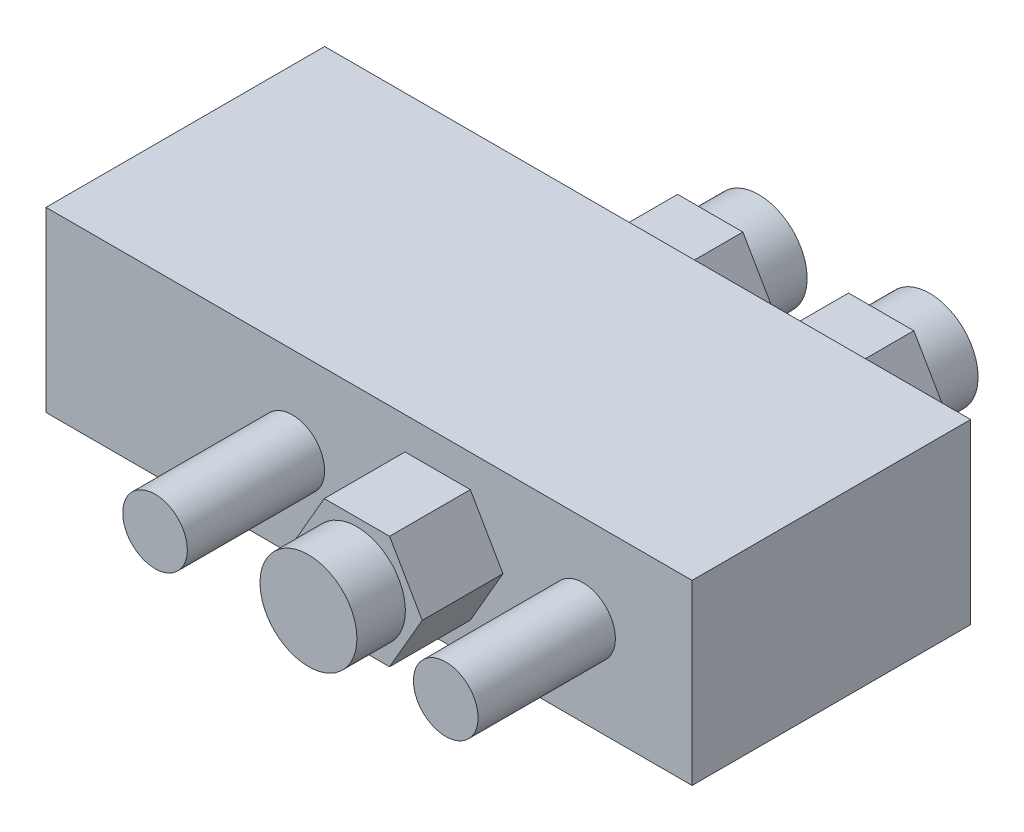
ISO-10303-21;
HEADER;
FILE_DESCRIPTION(('STEP AP214'),'2;1');
FILE_NAME('part.step','',(''),(''),'','','');
FILE_SCHEMA(('AUTOMOTIVE_DESIGN { 1 0 10303 214 1 1 1 1 }'));
ENDSEC;
DATA;
#1=APPLICATION_CONTEXT('core data for automotive mechanical design processes');
#2=APPLICATION_PROTOCOL_DEFINITION('international standard','automotive_design',2000,#1);
#3=PRODUCT_CONTEXT('',#1,'mechanical');
#4=PRODUCT('Part','Part','',(#3));
#5=PRODUCT_RELATED_PRODUCT_CATEGORY('part','',(#4));
#6=PRODUCT_DEFINITION_FORMATION('','',#4);
#7=PRODUCT_DEFINITION_CONTEXT('part definition',#1,'design');
#8=PRODUCT_DEFINITION('design','',#6,#7);
#9=PRODUCT_DEFINITION_SHAPE('','',#8);
#10=(LENGTH_UNIT() NAMED_UNIT(*) SI_UNIT(.MILLI.,.METRE.));
#11=(NAMED_UNIT(*) PLANE_ANGLE_UNIT() SI_UNIT($,.RADIAN.));
#12=(NAMED_UNIT(*) SI_UNIT($,.STERADIAN.) SOLID_ANGLE_UNIT());
#13=UNCERTAINTY_MEASURE_WITH_UNIT(LENGTH_MEASURE(1.E-05),#10,'distance_accuracy_value','');
#14=(GEOMETRIC_REPRESENTATION_CONTEXT(3) GLOBAL_UNCERTAINTY_ASSIGNED_CONTEXT((#13)) GLOBAL_UNIT_ASSIGNED_CONTEXT((#10,
#11,#12)) REPRESENTATION_CONTEXT('',''));
#15=CARTESIAN_POINT('',(0.,0.,0.));
#16=DIRECTION('',(0.,0.,1.));
#17=DIRECTION('',(1.,0.,0.));
#18=AXIS2_PLACEMENT_3D('',#15,#16,#17);
#19=CARTESIAN_POINT('',(0.,22.,0.));
#20=DIRECTION('',(0.,0.,-1.));
#21=DIRECTION('',(-1.,0.,0.));
#22=AXIS2_PLACEMENT_3D('',#19,#20,#21);
#23=PLANE('',#22);
#24=DIRECTION('',(1.,0.,0.));
#25=VECTOR('',#24,1.);
#26=CARTESIAN_POINT('',(0.,0.,0.));
#27=LINE('',#26,#25);
#28=CARTESIAN_POINT('',(0.,0.,0.));
#29=VERTEX_POINT('',#28);
#30=CARTESIAN_POINT('',(80.,0.,0.));
#31=VERTEX_POINT('',#30);
#32=EDGE_CURVE('E332',#29,#31,#27,.T.);
#33=ORIENTED_EDGE('',*,*,#32,.T.);
#34=DIRECTION('',(0.,-1.,0.));
#35=VECTOR('',#34,1.);
#36=CARTESIAN_POINT('',(80.,22.,0.));
#37=LINE('',#36,#35);
#38=CARTESIAN_POINT('',(80.,22.,0.));
#39=VERTEX_POINT('',#38);
#40=EDGE_CURVE('E342',#39,#31,#37,.T.);
#41=ORIENTED_EDGE('',*,*,#40,.F.);
#42=DIRECTION('',(1.,0.,0.));
#43=VECTOR('',#42,1.);
#44=CARTESIAN_POINT('',(0.,22.,0.));
#45=LINE('',#44,#43);
#46=CARTESIAN_POINT('',(0.,22.,0.));
#47=VERTEX_POINT('',#46);
#48=EDGE_CURVE('E322',#47,#39,#45,.T.);
#49=ORIENTED_EDGE('',*,*,#48,.F.);
#50=DIRECTION('',(0.,-1.,0.));
#51=VECTOR('',#50,1.);
#52=CARTESIAN_POINT('',(0.,22.,0.));
#53=LINE('',#52,#51);
#54=EDGE_CURVE('E318',#47,#29,#53,.T.);
#55=ORIENTED_EDGE('',*,*,#54,.T.);
#56=EDGE_LOOP('',(#33,#41,#49,#55));
#57=FACE_BOUND('',#56,.T.);
#58=CARTESIAN_POINT('',(30.5,11.,0.));
#59=DIRECTION('',(0.,0.,1.));
#60=DIRECTION('',(1.,0.,0.));
#61=AXIS2_PLACEMENT_3D('',#58,#59,#60);
#62=CIRCLE('',#61,4.);
#63=CARTESIAN_POINT('',(34.5,11.,0.));
#64=VERTEX_POINT('',#63);
#65=EDGE_CURVE('E315',#64,#64,#62,.T.);
#66=ORIENTED_EDGE('',*,*,#65,.F.);
#67=EDGE_LOOP('',(#66));
#68=FACE_BOUND('',#67,.T.);
#69=CARTESIAN_POINT('',(66.5,11.,0.));
#70=DIRECTION('',(0.,0.,-1.));
#71=DIRECTION('',(-1.,0.,0.));
#72=AXIS2_PLACEMENT_3D('',#69,#70,#71);
#73=CIRCLE('',#72,4.00000000000001);
#74=CARTESIAN_POINT('',(62.5,11.,0.));
#75=VERTEX_POINT('',#74);
#76=EDGE_CURVE('E37',#75,#75,#73,.F.);
#77=ORIENTED_EDGE('',*,*,#76,.F.);
#78=EDGE_LOOP('',(#77));
#79=FACE_BOUND('',#78,.T.);
#80=DIRECTION('',(0.5,0.866025403784439,0.));
#81=VECTOR('',#80,1.);
#82=CARTESIAN_POINT('',(52.5414518843274,4.,0.));
#83=LINE('',#82,#81);
#84=CARTESIAN_POINT('',(52.5414518843274,4.,0.));
#85=VERTEX_POINT('',#84);
#86=CARTESIAN_POINT('',(56.5829037686548,11.,0.));
#87=VERTEX_POINT('',#86);
#88=EDGE_CURVE('E204',#85,#87,#83,.T.);
#89=ORIENTED_EDGE('',*,*,#88,.F.);
#90=DIRECTION('',(1.,0.,0.));
#91=VECTOR('',#90,1.);
#92=CARTESIAN_POINT('',(44.4585481156726,4.,0.));
#93=LINE('',#92,#91);
#94=CARTESIAN_POINT('',(44.4585481156726,4.,0.));
#95=VERTEX_POINT('',#94);
#96=EDGE_CURVE('E201',#95,#85,#93,.T.);
#97=ORIENTED_EDGE('',*,*,#96,.F.);
#98=DIRECTION('',(0.5,-0.866025403784439,0.));
#99=VECTOR('',#98,1.);
#100=CARTESIAN_POINT('',(40.4170962313452,11.,0.));
#101=LINE('',#100,#99);
#102=CARTESIAN_POINT('',(40.4170962313452,11.,0.));
#103=VERTEX_POINT('',#102);
#104=EDGE_CURVE('E452',#103,#95,#101,.T.);
#105=ORIENTED_EDGE('',*,*,#104,.F.);
#106=DIRECTION('',(-0.500000000000001,-0.866025403784438,0.));
#107=VECTOR('',#106,1.);
#108=CARTESIAN_POINT('',(44.4585481156726,18.,0.));
#109=LINE('',#108,#107);
#110=CARTESIAN_POINT('',(44.4585481156726,18.,0.));
#111=VERTEX_POINT('',#110);
#112=EDGE_CURVE('E469',#111,#103,#109,.T.);
#113=ORIENTED_EDGE('',*,*,#112,.F.);
#114=DIRECTION('',(-1.,0.,0.));
#115=VECTOR('',#114,1.);
#116=CARTESIAN_POINT('',(52.5414518843274,18.,0.));
#117=LINE('',#116,#115);
#118=CARTESIAN_POINT('',(52.5414518843274,18.,0.));
#119=VERTEX_POINT('',#118);
#120=EDGE_CURVE('E55',#119,#111,#117,.T.);
#121=ORIENTED_EDGE('',*,*,#120,.F.);
#122=DIRECTION('',(-0.5,0.866025403784439,0.));
#123=VECTOR('',#122,1.);
#124=CARTESIAN_POINT('',(56.5829037686548,11.,0.));
#125=LINE('',#124,#123);
#126=EDGE_CURVE('E50',#87,#119,#125,.T.);
#127=ORIENTED_EDGE('',*,*,#126,.F.);
#128=EDGE_LOOP('',(#89,#97,#105,#113,#121,#127));
#129=FACE_BOUND('',#128,.T.);
#130=ADVANCED_FACE('F33',(#57,#68,#79,#129),#23,.F.);
#131=CARTESIAN_POINT('',(80.,22.,-34.5));
#132=DIRECTION('',(0.,0.,1.));
#133=DIRECTION('',(1.,0.,0.));
#134=AXIS2_PLACEMENT_3D('',#131,#132,#133);
#135=PLANE('',#134);
#136=DIRECTION('',(-0.499999999999999,0.866025403784439,0.));
#137=VECTOR('',#136,1.);
#138=CARTESIAN_POINT('',(54.8756443470179,3.99999999999999,-34.5));
#139=LINE('',#138,#137);
#140=CARTESIAN_POINT('',(54.8756443470179,3.99999999999999,-34.5));
#141=VERTEX_POINT('',#140);
#142=CARTESIAN_POINT('',(50.8341924626905,11.,-34.5));
#143=VERTEX_POINT('',#142);
#144=EDGE_CURVE('E259',#141,#143,#139,.T.);
#145=ORIENTED_EDGE('',*,*,#144,.F.);
#146=DIRECTION('',(-1.,0.,0.));
#147=VECTOR('',#146,1.);
#148=CARTESIAN_POINT('',(62.9585481156727,4.,-34.5));
#149=LINE('',#148,#147);
#150=CARTESIAN_POINT('',(62.9585481156727,4.,-34.5));
#151=VERTEX_POINT('',#150);
#152=EDGE_CURVE('E264',#151,#141,#149,.T.);
#153=ORIENTED_EDGE('',*,*,#152,.F.);
#154=DIRECTION('',(-0.5,-0.866025403784439,0.));
#155=VECTOR('',#154,1.);
#156=CARTESIAN_POINT('',(67.,10.9999999999999,-34.5));
#157=LINE('',#156,#155);
#158=CARTESIAN_POINT('',(67.,10.9999999999999,-34.5));
#159=VERTEX_POINT('',#158);
#160=EDGE_CURVE('E286',#159,#151,#157,.T.);
#161=ORIENTED_EDGE('',*,*,#160,.F.);
#162=DIRECTION('',(0.499999999999995,-0.866025403784441,0.));
#163=VECTOR('',#162,1.);
#164=CARTESIAN_POINT('',(62.9585481156727,18.,-34.5));
#165=LINE('',#164,#163);
#166=CARTESIAN_POINT('',(62.9585481156727,18.,-34.5));
#167=VERTEX_POINT('',#166);
#168=EDGE_CURVE('E283',#167,#159,#165,.T.);
#169=ORIENTED_EDGE('',*,*,#168,.F.);
#170=DIRECTION('',(1.,0.,0.));
#171=VECTOR('',#170,1.);
#172=CARTESIAN_POINT('',(54.8756443470179,18.,-34.5));
#173=LINE('',#172,#171);
#174=CARTESIAN_POINT('',(54.8756443470179,18.,-34.5));
#175=VERTEX_POINT('',#174);
#176=EDGE_CURVE('E280',#175,#167,#173,.T.);
#177=ORIENTED_EDGE('',*,*,#176,.F.);
#178=DIRECTION('',(0.5,0.866025403784438,0.));
#179=VECTOR('',#178,1.);
#180=CARTESIAN_POINT('',(50.8341924626905,11.,-34.5));
#181=LINE('',#180,#179);
#182=EDGE_CURVE('E277',#143,#175,#181,.T.);
#183=ORIENTED_EDGE('',*,*,#182,.F.);
#184=EDGE_LOOP('',(#145,#153,#161,#169,#177,#183));
#185=FACE_BOUND('',#184,.T.);
#186=DIRECTION('',(-1.,0.,0.));
#187=VECTOR('',#186,1.);
#188=CARTESIAN_POINT('',(80.,0.,-34.5));
#189=LINE('',#188,#187);
#190=CARTESIAN_POINT('',(80.,0.,-34.5));
#191=VERTEX_POINT('',#190);
#192=CARTESIAN_POINT('',(0.,0.,-34.5));
#193=VERTEX_POINT('',#192);
#194=EDGE_CURVE('E323',#191,#193,#189,.T.);
#195=ORIENTED_EDGE('',*,*,#194,.T.);
#196=DIRECTION('',(0.,-1.,0.));
#197=VECTOR('',#196,1.);
#198=CARTESIAN_POINT('',(0.,22.,-34.5));
#199=LINE('',#198,#197);
#200=CARTESIAN_POINT('',(0.,22.,-34.5));
#201=VERTEX_POINT('',#200);
#202=EDGE_CURVE('E329',#201,#193,#199,.T.);
#203=ORIENTED_EDGE('',*,*,#202,.F.);
#204=DIRECTION('',(-1.,0.,0.));
#205=VECTOR('',#204,1.);
#206=CARTESIAN_POINT('',(80.,22.,-34.5));
#207=LINE('',#206,#205);
#208=CARTESIAN_POINT('',(80.,22.,-34.5));
#209=VERTEX_POINT('',#208);
#210=EDGE_CURVE('E327',#209,#201,#207,.T.);
#211=ORIENTED_EDGE('',*,*,#210,.F.);
#212=DIRECTION('',(0.,-1.,0.));
#213=VECTOR('',#212,1.);
#214=CARTESIAN_POINT('',(80.,22.,-34.5));
#215=LINE('',#214,#213);
#216=EDGE_CURVE('E339',#209,#191,#215,.T.);
#217=ORIENTED_EDGE('',*,*,#216,.T.);
#218=EDGE_LOOP('',(#195,#203,#211,#217));
#219=FACE_BOUND('',#218,.T.);
#220=DIRECTION('',(-0.5,0.866025403784439,0.));
#221=VECTOR('',#220,1.);
#222=CARTESIAN_POINT('',(33.7098368097084,4.,-34.5));
#223=LINE('',#222,#221);
#224=CARTESIAN_POINT('',(33.7098368097084,4.,-34.5));
#225=VERTEX_POINT('',#224);
#226=CARTESIAN_POINT('',(29.668384925381,11.,-34.5));
#227=VERTEX_POINT('',#226);
#228=EDGE_CURVE('E205',#225,#227,#223,.T.);
#229=ORIENTED_EDGE('',*,*,#228,.F.);
#230=DIRECTION('',(-1.,0.,0.));
#231=VECTOR('',#230,1.);
#232=CARTESIAN_POINT('',(41.7927405783631,4.,-34.5));
#233=LINE('',#232,#231);
#234=CARTESIAN_POINT('',(41.7927405783631,4.,-34.5));
#235=VERTEX_POINT('',#234);
#236=EDGE_CURVE('E218',#235,#225,#233,.T.);
#237=ORIENTED_EDGE('',*,*,#236,.F.);
#238=DIRECTION('',(-0.499999999999999,-0.866025403784439,0.));
#239=VECTOR('',#238,1.);
#240=CARTESIAN_POINT('',(45.8341924626905,11.,-34.5));
#241=LINE('',#240,#239);
#242=CARTESIAN_POINT('',(45.8341924626905,11.,-34.5));
#243=VERTEX_POINT('',#242);
#244=EDGE_CURVE('E237',#243,#235,#241,.T.);
#245=ORIENTED_EDGE('',*,*,#244,.F.);
#246=DIRECTION('',(0.5,-0.866025403784439,0.));
#247=VECTOR('',#246,1.);
#248=CARTESIAN_POINT('',(41.7927405783631,18.,-34.5));
#249=LINE('',#248,#247);
#250=CARTESIAN_POINT('',(41.7927405783631,18.,-34.5));
#251=VERTEX_POINT('',#250);
#252=EDGE_CURVE('E234',#251,#243,#249,.T.);
#253=ORIENTED_EDGE('',*,*,#252,.F.);
#254=DIRECTION('',(1.,0.,0.));
#255=VECTOR('',#254,1.);
#256=CARTESIAN_POINT('',(33.7098368097084,18.,-34.5));
#257=LINE('',#256,#255);
#258=CARTESIAN_POINT('',(33.7098368097084,18.,-34.5));
#259=VERTEX_POINT('',#258);
#260=EDGE_CURVE('E231',#259,#251,#257,.T.);
#261=ORIENTED_EDGE('',*,*,#260,.F.);
#262=DIRECTION('',(0.5,0.866025403784439,0.));
#263=VECTOR('',#262,1.);
#264=CARTESIAN_POINT('',(29.668384925381,11.,-34.5));
#265=LINE('',#264,#263);
#266=EDGE_CURVE('E208',#227,#259,#265,.T.);
#267=ORIENTED_EDGE('',*,*,#266,.F.);
#268=EDGE_LOOP('',(#229,#237,#245,#253,#261,#267));
#269=FACE_BOUND('',#268,.T.);
#270=ADVANCED_FACE('F363',(#185,#219,#269),#135,.F.);
#271=CARTESIAN_POINT('',(0.,22.,-34.5));
#272=DIRECTION('',(1.,0.,0.));
#273=DIRECTION('',(0.,0.,-1.));
#274=AXIS2_PLACEMENT_3D('',#271,#272,#273);
#275=PLANE('',#274);
#276=DIRECTION('',(0.,0.,1.));
#277=VECTOR('',#276,1.);
#278=CARTESIAN_POINT('',(0.,0.,-34.5));
#279=LINE('',#278,#277);
#280=EDGE_CURVE('E314',#193,#29,#279,.T.);
#281=ORIENTED_EDGE('',*,*,#280,.T.);
#282=ORIENTED_EDGE('',*,*,#54,.F.);
#283=DIRECTION('',(0.,0.,1.));
#284=VECTOR('',#283,1.);
#285=CARTESIAN_POINT('',(0.,22.,-34.5));
#286=LINE('',#285,#284);
#287=EDGE_CURVE('E319',#201,#47,#286,.T.);
#288=ORIENTED_EDGE('',*,*,#287,.F.);
#289=ORIENTED_EDGE('',*,*,#202,.T.);
#290=EDGE_LOOP('',(#281,#282,#288,#289));
#291=FACE_BOUND('',#290,.T.);
#292=ADVANCED_FACE('F35',(#291),#275,.F.);
#293=CARTESIAN_POINT('',(80.,22.,0.));
#294=DIRECTION('',(-1.,0.,0.));
#295=DIRECTION('',(0.,0.,1.));
#296=AXIS2_PLACEMENT_3D('',#293,#294,#295);
#297=PLANE('',#296);
#298=DIRECTION('',(0.,0.,-1.));
#299=VECTOR('',#298,1.);
#300=CARTESIAN_POINT('',(80.,0.,0.));
#301=LINE('',#300,#299);
#302=EDGE_CURVE('E334',#31,#191,#301,.T.);
#303=ORIENTED_EDGE('',*,*,#302,.T.);
#304=ORIENTED_EDGE('',*,*,#216,.F.);
#305=DIRECTION('',(0.,0.,-1.));
#306=VECTOR('',#305,1.);
#307=CARTESIAN_POINT('',(80.,22.,0.));
#308=LINE('',#307,#306);
#309=EDGE_CURVE('E325',#39,#209,#308,.T.);
#310=ORIENTED_EDGE('',*,*,#309,.F.);
#311=ORIENTED_EDGE('',*,*,#40,.T.);
#312=EDGE_LOOP('',(#303,#304,#310,#311));
#313=FACE_BOUND('',#312,.T.);
#314=ADVANCED_FACE('F359',(#313),#297,.F.);
#315=CARTESIAN_POINT('',(0.,22.,0.));
#316=DIRECTION('',(0.,1.,0.));
#317=DIRECTION('',(0.,0.,1.));
#318=AXIS2_PLACEMENT_3D('',#315,#316,#317);
#319=PLANE('',#318);
#320=ORIENTED_EDGE('',*,*,#287,.T.);
#321=ORIENTED_EDGE('',*,*,#48,.T.);
#322=ORIENTED_EDGE('',*,*,#309,.T.);
#323=ORIENTED_EDGE('',*,*,#210,.T.);
#324=EDGE_LOOP('',(#320,#321,#322,#323));
#325=FACE_BOUND('',#324,.T.);
#326=ADVANCED_FACE('F366',(#325),#319,.T.);
#327=CARTESIAN_POINT('',(0.,0.,0.));
#328=DIRECTION('',(0.,1.,0.));
#329=DIRECTION('',(0.,0.,1.));
#330=AXIS2_PLACEMENT_3D('',#327,#328,#329);
#331=PLANE('',#330);
#332=ORIENTED_EDGE('',*,*,#280,.F.);
#333=ORIENTED_EDGE('',*,*,#194,.F.);
#334=ORIENTED_EDGE('',*,*,#302,.F.);
#335=ORIENTED_EDGE('',*,*,#32,.F.);
#336=EDGE_LOOP('',(#332,#333,#334,#335));
#337=FACE_BOUND('',#336,.T.);
#338=ADVANCED_FACE('F355',(#337),#331,.F.);
#339=CARTESIAN_POINT('',(30.5,11.,17.));
#340=DIRECTION('',(0.,0.,-1.));
#341=DIRECTION('',(-1.,0.,0.));
#342=AXIS2_PLACEMENT_3D('',#339,#340,#341);
#343=CYLINDRICAL_SURFACE('',#342,4.);
#344=CARTESIAN_POINT('',(30.5,11.,17.));
#345=DIRECTION('',(0.,0.,1.));
#346=DIRECTION('',(1.,0.,0.));
#347=AXIS2_PLACEMENT_3D('',#344,#345,#346);
#348=CIRCLE('',#347,4.);
#349=CARTESIAN_POINT('',(34.5,11.,17.));
#350=VERTEX_POINT('',#349);
#351=EDGE_CURVE('E311',#350,#350,#348,.T.);
#352=ORIENTED_EDGE('',*,*,#351,.F.);
#353=EDGE_LOOP('',(#352));
#354=FACE_BOUND('',#353,.T.);
#355=ORIENTED_EDGE('',*,*,#65,.T.);
#356=EDGE_LOOP('',(#355));
#357=FACE_BOUND('',#356,.T.);
#358=ADVANCED_FACE('F373',(#354,#357),#343,.T.);
#359=CARTESIAN_POINT('',(30.5,11.,17.));
#360=DIRECTION('',(0.,0.,1.));
#361=DIRECTION('',(1.,0.,0.));
#362=AXIS2_PLACEMENT_3D('',#359,#360,#361);
#363=PLANE('',#362);
#364=ORIENTED_EDGE('',*,*,#351,.T.);
#365=EDGE_LOOP('',(#364));
#366=FACE_BOUND('',#365,.T.);
#367=ADVANCED_FACE('F428',(#366),#363,.T.);
#368=CARTESIAN_POINT('',(66.5,11.,17.));
#369=DIRECTION('',(0.,0.,-1.));
#370=DIRECTION('',(-1.,0.,0.));
#371=AXIS2_PLACEMENT_3D('',#368,#369,#370);
#372=CYLINDRICAL_SURFACE('',#371,4.00000000000001);
#373=CARTESIAN_POINT('',(66.5,11.,17.));
#374=DIRECTION('',(0.,0.,1.));
#375=DIRECTION('',(1.,0.,0.));
#376=AXIS2_PLACEMENT_3D('',#373,#374,#375);
#377=CIRCLE('',#376,4.00000000000001);
#378=CARTESIAN_POINT('',(70.5,11.,17.));
#379=VERTEX_POINT('',#378);
#380=EDGE_CURVE('E308',#379,#379,#377,.T.);
#381=ORIENTED_EDGE('',*,*,#380,.F.);
#382=EDGE_LOOP('',(#381));
#383=FACE_BOUND('',#382,.T.);
#384=ORIENTED_EDGE('',*,*,#76,.T.);
#385=EDGE_LOOP('',(#384));
#386=FACE_BOUND('',#385,.T.);
#387=ADVANCED_FACE('F424',(#383,#386),#372,.T.);
#388=CARTESIAN_POINT('',(66.5,11.,17.));
#389=DIRECTION('',(0.,0.,1.));
#390=DIRECTION('',(1.,0.,0.));
#391=AXIS2_PLACEMENT_3D('',#388,#389,#390);
#392=PLANE('',#391);
#393=ORIENTED_EDGE('',*,*,#380,.T.);
#394=EDGE_LOOP('',(#393));
#395=FACE_BOUND('',#394,.T.);
#396=ADVANCED_FACE('F418',(#395),#392,.T.);
#397=CARTESIAN_POINT('',(54.8756443470179,3.99999999999999,-44.5));
#398=DIRECTION('',(0.866025403784439,0.499999999999999,0.));
#399=DIRECTION('',(-0.499999999999999,0.866025403784439,0.));
#400=AXIS2_PLACEMENT_3D('',#397,#398,#399);
#401=PLANE('',#400);
#402=ORIENTED_EDGE('',*,*,#144,.T.);
#403=DIRECTION('',(0.,0.,1.));
#404=VECTOR('',#403,1.);
#405=CARTESIAN_POINT('',(50.8341924626905,11.,-44.5));
#406=LINE('',#405,#404);
#407=CARTESIAN_POINT('',(50.8341924626905,11.,-44.5));
#408=VERTEX_POINT('',#407);
#409=EDGE_CURVE('E305',#408,#143,#406,.T.);
#410=ORIENTED_EDGE('',*,*,#409,.F.);
#411=DIRECTION('',(-0.499999999999999,0.866025403784439,0.));
#412=VECTOR('',#411,1.);
#413=CARTESIAN_POINT('',(54.8756443470179,3.99999999999999,-44.5));
#414=LINE('',#413,#412);
#415=CARTESIAN_POINT('',(54.8756443470179,3.99999999999999,-44.5));
#416=VERTEX_POINT('',#415);
#417=EDGE_CURVE('E260',#416,#408,#414,.T.);
#418=ORIENTED_EDGE('',*,*,#417,.F.);
#419=DIRECTION('',(0.,0.,1.));
#420=VECTOR('',#419,1.);
#421=CARTESIAN_POINT('',(54.8756443470179,3.99999999999999,-44.5));
#422=LINE('',#421,#420);
#423=EDGE_CURVE('E274',#416,#141,#422,.T.);
#424=ORIENTED_EDGE('',*,*,#423,.T.);
#425=EDGE_LOOP('',(#402,#410,#418,#424));
#426=FACE_BOUND('',#425,.T.);
#427=ADVANCED_FACE('F394',(#426),#401,.F.);
#428=CARTESIAN_POINT('',(50.8341924626905,11.,-44.5));
#429=DIRECTION('',(0.866025403784438,-0.5,0.));
#430=DIRECTION('',(0.5,0.866025403784438,0.));
#431=AXIS2_PLACEMENT_3D('',#428,#429,#430);
#432=PLANE('',#431);
#433=ORIENTED_EDGE('',*,*,#182,.T.);
#434=DIRECTION('',(0.,0.,1.));
#435=VECTOR('',#434,1.);
#436=CARTESIAN_POINT('',(54.8756443470179,18.,-44.5));
#437=LINE('',#436,#435);
#438=CARTESIAN_POINT('',(54.8756443470179,18.,-44.5));
#439=VERTEX_POINT('',#438);
#440=EDGE_CURVE('E302',#439,#175,#437,.T.);
#441=ORIENTED_EDGE('',*,*,#440,.F.);
#442=DIRECTION('',(0.5,0.866025403784438,0.));
#443=VECTOR('',#442,1.);
#444=CARTESIAN_POINT('',(50.8341924626905,11.,-44.5));
#445=LINE('',#444,#443);
#446=EDGE_CURVE('E263',#408,#439,#445,.T.);
#447=ORIENTED_EDGE('',*,*,#446,.F.);
#448=ORIENTED_EDGE('',*,*,#409,.T.);
#449=EDGE_LOOP('',(#433,#441,#447,#448));
#450=FACE_BOUND('',#449,.T.);
#451=ADVANCED_FACE('F410',(#450),#432,.F.);
#452=CARTESIAN_POINT('',(54.8756443470179,18.,-44.5));
#453=DIRECTION('',(0.,-1.,0.));
#454=DIRECTION('',(1.,0.,0.));
#455=AXIS2_PLACEMENT_3D('',#452,#453,#454);
#456=PLANE('',#455);
#457=ORIENTED_EDGE('',*,*,#176,.T.);
#458=DIRECTION('',(0.,0.,1.));
#459=VECTOR('',#458,1.);
#460=CARTESIAN_POINT('',(62.9585481156727,18.,-44.5));
#461=LINE('',#460,#459);
#462=CARTESIAN_POINT('',(62.9585481156727,18.,-44.5));
#463=VERTEX_POINT('',#462);
#464=EDGE_CURVE('E299',#463,#167,#461,.T.);
#465=ORIENTED_EDGE('',*,*,#464,.F.);
#466=DIRECTION('',(1.,0.,0.));
#467=VECTOR('',#466,1.);
#468=CARTESIAN_POINT('',(54.8756443470179,18.,-44.5));
#469=LINE('',#468,#467);
#470=EDGE_CURVE('E266',#439,#463,#469,.T.);
#471=ORIENTED_EDGE('',*,*,#470,.F.);
#472=ORIENTED_EDGE('',*,*,#440,.T.);
#473=EDGE_LOOP('',(#457,#465,#471,#472));
#474=FACE_BOUND('',#473,.T.);
#475=ADVANCED_FACE('F408',(#474),#456,.F.);
#476=CARTESIAN_POINT('',(62.9585481156727,18.,-44.5));
#477=DIRECTION('',(-0.866025403784442,-0.499999999999995,0.));
#478=DIRECTION('',(0.499999999999995,-0.866025403784442,0.));
#479=AXIS2_PLACEMENT_3D('',#476,#477,#478);
#480=PLANE('',#479);
#481=ORIENTED_EDGE('',*,*,#168,.T.);
#482=DIRECTION('',(0.,0.,1.));
#483=VECTOR('',#482,1.);
#484=CARTESIAN_POINT('',(67.,10.9999999999999,-44.5));
#485=LINE('',#484,#483);
#486=CARTESIAN_POINT('',(67.,10.9999999999999,-44.5));
#487=VERTEX_POINT('',#486);
#488=EDGE_CURVE('E296',#487,#159,#485,.T.);
#489=ORIENTED_EDGE('',*,*,#488,.F.);
#490=DIRECTION('',(0.499999999999995,-0.866025403784441,0.));
#491=VECTOR('',#490,1.);
#492=CARTESIAN_POINT('',(62.9585481156727,18.,-44.5));
#493=LINE('',#492,#491);
#494=EDGE_CURVE('E268',#463,#487,#493,.T.);
#495=ORIENTED_EDGE('',*,*,#494,.F.);
#496=ORIENTED_EDGE('',*,*,#464,.T.);
#497=EDGE_LOOP('',(#481,#489,#495,#496));
#498=FACE_BOUND('',#497,.T.);
#499=ADVANCED_FACE('F404',(#498),#480,.F.);
#500=CARTESIAN_POINT('',(67.,10.9999999999999,-44.5));
#501=DIRECTION('',(-0.866025403784439,0.5,0.));
#502=DIRECTION('',(-0.5,-0.866025403784439,0.));
#503=AXIS2_PLACEMENT_3D('',#500,#501,#502);
#504=PLANE('',#503);
#505=ORIENTED_EDGE('',*,*,#160,.T.);
#506=DIRECTION('',(0.,0.,1.));
#507=VECTOR('',#506,1.);
#508=CARTESIAN_POINT('',(62.9585481156727,4.,-44.5));
#509=LINE('',#508,#507);
#510=CARTESIAN_POINT('',(62.9585481156727,4.,-44.5));
#511=VERTEX_POINT('',#510);
#512=EDGE_CURVE('E293',#511,#151,#509,.T.);
#513=ORIENTED_EDGE('',*,*,#512,.F.);
#514=DIRECTION('',(-0.5,-0.866025403784439,0.));
#515=VECTOR('',#514,1.);
#516=CARTESIAN_POINT('',(67.,10.9999999999999,-44.5));
#517=LINE('',#516,#515);
#518=EDGE_CURVE('E270',#487,#511,#517,.T.);
#519=ORIENTED_EDGE('',*,*,#518,.F.);
#520=ORIENTED_EDGE('',*,*,#488,.T.);
#521=EDGE_LOOP('',(#505,#513,#519,#520));
#522=FACE_BOUND('',#521,.T.);
#523=ADVANCED_FACE('F402',(#522),#504,.F.);
#524=CARTESIAN_POINT('',(62.9585481156727,4.,-44.5));
#525=DIRECTION('',(0.,1.,0.));
#526=DIRECTION('',(-1.,0.,0.));
#527=AXIS2_PLACEMENT_3D('',#524,#525,#526);
#528=PLANE('',#527);
#529=ORIENTED_EDGE('',*,*,#152,.T.);
#530=ORIENTED_EDGE('',*,*,#423,.F.);
#531=DIRECTION('',(-1.,0.,0.));
#532=VECTOR('',#531,1.);
#533=CARTESIAN_POINT('',(62.9585481156727,4.,-44.5));
#534=LINE('',#533,#532);
#535=EDGE_CURVE('E272',#511,#416,#534,.T.);
#536=ORIENTED_EDGE('',*,*,#535,.F.);
#537=ORIENTED_EDGE('',*,*,#512,.T.);
#538=EDGE_LOOP('',(#529,#530,#536,#537));
#539=FACE_BOUND('',#538,.T.);
#540=ADVANCED_FACE('F390',(#539),#528,.F.);
#541=CARTESIAN_POINT('',(0.,0.,-44.5));
#542=DIRECTION('',(0.,0.,-1.));
#543=DIRECTION('',(-1.,0.,0.));
#544=AXIS2_PLACEMENT_3D('',#541,#542,#543);
#545=PLANE('',#544);
#546=CARTESIAN_POINT('',(58.9170962313453,11.,-44.5));
#547=DIRECTION('',(0.,0.,-1.));
#548=DIRECTION('',(-1.,0.,0.));
#549=AXIS2_PLACEMENT_3D('',#546,#547,#548);
#550=CIRCLE('',#549,5.99999999999999);
#551=CARTESIAN_POINT('',(52.9170962313453,11.,-44.5));
#552=VERTEX_POINT('',#551);
#553=EDGE_CURVE('E42',#552,#552,#550,.T.);
#554=ORIENTED_EDGE('',*,*,#553,.F.);
#555=EDGE_LOOP('',(#554));
#556=FACE_BOUND('',#555,.T.);
#557=ORIENTED_EDGE('',*,*,#417,.T.);
#558=ORIENTED_EDGE('',*,*,#446,.T.);
#559=ORIENTED_EDGE('',*,*,#470,.T.);
#560=ORIENTED_EDGE('',*,*,#494,.T.);
#561=ORIENTED_EDGE('',*,*,#518,.T.);
#562=ORIENTED_EDGE('',*,*,#535,.T.);
#563=EDGE_LOOP('',(#557,#558,#559,#560,#561,#562));
#564=FACE_BOUND('',#563,.T.);
#565=ADVANCED_FACE('F396',(#556,#564),#545,.T.);
#566=CARTESIAN_POINT('',(33.7098368097084,4.,-44.5));
#567=DIRECTION('',(0.866025403784439,0.5,0.));
#568=DIRECTION('',(-0.5,0.866025403784439,0.));
#569=AXIS2_PLACEMENT_3D('',#566,#567,#568);
#570=PLANE('',#569);
#571=ORIENTED_EDGE('',*,*,#228,.T.);
#572=DIRECTION('',(0.,0.,1.));
#573=VECTOR('',#572,1.);
#574=CARTESIAN_POINT('',(29.668384925381,11.,-44.5));
#575=LINE('',#574,#573);
#576=CARTESIAN_POINT('',(29.668384925381,11.,-44.5));
#577=VERTEX_POINT('',#576);
#578=EDGE_CURVE('E256',#577,#227,#575,.T.);
#579=ORIENTED_EDGE('',*,*,#578,.F.);
#580=DIRECTION('',(-0.5,0.866025403784439,0.));
#581=VECTOR('',#580,1.);
#582=CARTESIAN_POINT('',(33.7098368097084,4.,-44.5));
#583=LINE('',#582,#581);
#584=CARTESIAN_POINT('',(33.7098368097084,4.,-44.5));
#585=VERTEX_POINT('',#584);
#586=EDGE_CURVE('E214',#585,#577,#583,.T.);
#587=ORIENTED_EDGE('',*,*,#586,.F.);
#588=DIRECTION('',(0.,0.,1.));
#589=VECTOR('',#588,1.);
#590=CARTESIAN_POINT('',(33.7098368097084,4.,-44.5));
#591=LINE('',#590,#589);
#592=EDGE_CURVE('E227',#585,#225,#591,.T.);
#593=ORIENTED_EDGE('',*,*,#592,.T.);
#594=EDGE_LOOP('',(#571,#579,#587,#593));
#595=FACE_BOUND('',#594,.T.);
#596=ADVANCED_FACE('F517',(#595),#570,.F.);
#597=CARTESIAN_POINT('',(29.668384925381,11.,-44.5));
#598=DIRECTION('',(0.866025403784439,-0.5,0.));
#599=DIRECTION('',(0.5,0.866025403784439,0.));
#600=AXIS2_PLACEMENT_3D('',#597,#598,#599);
#601=PLANE('',#600);
#602=ORIENTED_EDGE('',*,*,#266,.T.);
#603=DIRECTION('',(0.,0.,1.));
#604=VECTOR('',#603,1.);
#605=CARTESIAN_POINT('',(33.7098368097084,18.,-44.5));
#606=LINE('',#605,#604);
#607=CARTESIAN_POINT('',(33.7098368097084,18.,-44.5));
#608=VERTEX_POINT('',#607);
#609=EDGE_CURVE('E253',#608,#259,#606,.T.);
#610=ORIENTED_EDGE('',*,*,#609,.F.);
#611=DIRECTION('',(0.5,0.866025403784439,0.));
#612=VECTOR('',#611,1.);
#613=CARTESIAN_POINT('',(29.668384925381,11.,-44.5));
#614=LINE('',#613,#612);
#615=EDGE_CURVE('E217',#577,#608,#614,.T.);
#616=ORIENTED_EDGE('',*,*,#615,.F.);
#617=ORIENTED_EDGE('',*,*,#578,.T.);
#618=EDGE_LOOP('',(#602,#610,#616,#617));
#619=FACE_BOUND('',#618,.T.);
#620=ADVANCED_FACE('F519',(#619),#601,.F.);
#621=CARTESIAN_POINT('',(33.7098368097084,18.,-44.5));
#622=DIRECTION('',(0.,-1.,0.));
#623=DIRECTION('',(0.,0.,-1.));
#624=AXIS2_PLACEMENT_3D('',#621,#622,#623);
#625=PLANE('',#624);
#626=ORIENTED_EDGE('',*,*,#260,.T.);
#627=DIRECTION('',(0.,0.,1.));
#628=VECTOR('',#627,1.);
#629=CARTESIAN_POINT('',(41.7927405783631,18.,-44.5));
#630=LINE('',#629,#628);
#631=CARTESIAN_POINT('',(41.7927405783631,18.,-44.5));
#632=VERTEX_POINT('',#631);
#633=EDGE_CURVE('E250',#632,#251,#630,.T.);
#634=ORIENTED_EDGE('',*,*,#633,.F.);
#635=DIRECTION('',(1.,0.,0.));
#636=VECTOR('',#635,1.);
#637=CARTESIAN_POINT('',(33.7098368097084,18.,-44.5));
#638=LINE('',#637,#636);
#639=EDGE_CURVE('E220',#608,#632,#638,.T.);
#640=ORIENTED_EDGE('',*,*,#639,.F.);
#641=ORIENTED_EDGE('',*,*,#609,.T.);
#642=EDGE_LOOP('',(#626,#634,#640,#641));
#643=FACE_BOUND('',#642,.T.);
#644=ADVANCED_FACE('F523',(#643),#625,.F.);
#645=CARTESIAN_POINT('',(41.7927405783631,18.,-44.5));
#646=DIRECTION('',(-0.866025403784439,-0.5,0.));
#647=DIRECTION('',(0.5,-0.866025403784439,0.));
#648=AXIS2_PLACEMENT_3D('',#645,#646,#647);
#649=PLANE('',#648);
#650=ORIENTED_EDGE('',*,*,#252,.T.);
#651=DIRECTION('',(0.,0.,1.));
#652=VECTOR('',#651,1.);
#653=CARTESIAN_POINT('',(45.8341924626905,11.,-44.5));
#654=LINE('',#653,#652);
#655=CARTESIAN_POINT('',(45.8341924626905,11.,-44.5));
#656=VERTEX_POINT('',#655);
#657=EDGE_CURVE('E247',#656,#243,#654,.T.);
#658=ORIENTED_EDGE('',*,*,#657,.F.);
#659=DIRECTION('',(0.5,-0.866025403784439,0.));
#660=VECTOR('',#659,1.);
#661=CARTESIAN_POINT('',(41.7927405783631,18.,-44.5));
#662=LINE('',#661,#660);
#663=EDGE_CURVE('E222',#632,#656,#662,.T.);
#664=ORIENTED_EDGE('',*,*,#663,.F.);
#665=ORIENTED_EDGE('',*,*,#633,.T.);
#666=EDGE_LOOP('',(#650,#658,#664,#665));
#667=FACE_BOUND('',#666,.T.);
#668=ADVANCED_FACE('F529',(#667),#649,.F.);
#669=CARTESIAN_POINT('',(45.8341924626905,11.,-44.5));
#670=DIRECTION('',(-0.866025403784439,0.499999999999999,0.));
#671=DIRECTION('',(-0.499999999999999,-0.866025403784439,0.));
#672=AXIS2_PLACEMENT_3D('',#669,#670,#671);
#673=PLANE('',#672);
#674=ORIENTED_EDGE('',*,*,#244,.T.);
#675=DIRECTION('',(0.,0.,1.));
#676=VECTOR('',#675,1.);
#677=CARTESIAN_POINT('',(41.7927405783631,4.,-44.5));
#678=LINE('',#677,#676);
#679=CARTESIAN_POINT('',(41.7927405783631,4.,-44.5));
#680=VERTEX_POINT('',#679);
#681=EDGE_CURVE('E244',#680,#235,#678,.T.);
#682=ORIENTED_EDGE('',*,*,#681,.F.);
#683=DIRECTION('',(-0.499999999999999,-0.866025403784439,0.));
#684=VECTOR('',#683,1.);
#685=CARTESIAN_POINT('',(45.8341924626905,11.,-44.5));
#686=LINE('',#685,#684);
#687=EDGE_CURVE('E224',#656,#680,#686,.T.);
#688=ORIENTED_EDGE('',*,*,#687,.F.);
#689=ORIENTED_EDGE('',*,*,#657,.T.);
#690=EDGE_LOOP('',(#674,#682,#688,#689));
#691=FACE_BOUND('',#690,.T.);
#692=ADVANCED_FACE('F531',(#691),#673,.F.);
#693=CARTESIAN_POINT('',(41.7927405783631,4.,-44.5));
#694=DIRECTION('',(0.,1.,0.));
#695=DIRECTION('',(0.,0.,1.));
#696=AXIS2_PLACEMENT_3D('',#693,#694,#695);
#697=PLANE('',#696);
#698=ORIENTED_EDGE('',*,*,#236,.T.);
#699=ORIENTED_EDGE('',*,*,#592,.F.);
#700=DIRECTION('',(-1.,0.,0.));
#701=VECTOR('',#700,1.);
#702=CARTESIAN_POINT('',(41.7927405783631,4.,-44.5));
#703=LINE('',#702,#701);
#704=EDGE_CURVE('E226',#680,#585,#703,.T.);
#705=ORIENTED_EDGE('',*,*,#704,.F.);
#706=ORIENTED_EDGE('',*,*,#681,.T.);
#707=EDGE_LOOP('',(#698,#699,#705,#706));
#708=FACE_BOUND('',#707,.T.);
#709=ADVANCED_FACE('F509',(#708),#697,.F.);
#710=CARTESIAN_POINT('',(0.,0.,-44.5));
#711=DIRECTION('',(0.,0.,-1.));
#712=DIRECTION('',(-1.,0.,0.));
#713=AXIS2_PLACEMENT_3D('',#710,#711,#712);
#714=PLANE('',#713);
#715=CARTESIAN_POINT('',(37.7512886940358,11.,-44.5));
#716=DIRECTION('',(0.,0.,-1.));
#717=DIRECTION('',(-1.,0.,0.));
#718=AXIS2_PLACEMENT_3D('',#715,#716,#717);
#719=CIRCLE('',#718,5.99999999999999);
#720=CARTESIAN_POINT('',(31.7512886940358,11.,-44.5));
#721=VERTEX_POINT('',#720);
#722=EDGE_CURVE('E11',#721,#721,#719,.T.);
#723=ORIENTED_EDGE('',*,*,#722,.F.);
#724=EDGE_LOOP('',(#723));
#725=FACE_BOUND('',#724,.T.);
#726=ORIENTED_EDGE('',*,*,#586,.T.);
#727=ORIENTED_EDGE('',*,*,#615,.T.);
#728=ORIENTED_EDGE('',*,*,#639,.T.);
#729=ORIENTED_EDGE('',*,*,#663,.T.);
#730=ORIENTED_EDGE('',*,*,#687,.T.);
#731=ORIENTED_EDGE('',*,*,#704,.T.);
#732=EDGE_LOOP('',(#726,#727,#728,#729,#730,#731));
#733=FACE_BOUND('',#732,.T.);
#734=ADVANCED_FACE('F506',(#725,#733),#714,.T.);
#735=CARTESIAN_POINT('',(52.5414518843274,4.,10.));
#736=DIRECTION('',(-0.866025403784438,0.5,0.));
#737=DIRECTION('',(-0.5,-0.866025403784438,0.));
#738=AXIS2_PLACEMENT_3D('',#735,#736,#737);
#739=PLANE('',#738);
#740=ORIENTED_EDGE('',*,*,#88,.T.);
#741=DIRECTION('',(0.,0.,-1.));
#742=VECTOR('',#741,1.);
#743=CARTESIAN_POINT('',(56.5829037686548,11.,10.));
#744=LINE('',#743,#742);
#745=CARTESIAN_POINT('',(56.5829037686548,11.,10.));
#746=VERTEX_POINT('',#745);
#747=EDGE_CURVE('E185',#746,#87,#744,.T.);
#748=ORIENTED_EDGE('',*,*,#747,.F.);
#749=DIRECTION('',(0.5,0.866025403784439,0.));
#750=VECTOR('',#749,1.);
#751=CARTESIAN_POINT('',(52.5414518843274,4.,10.));
#752=LINE('',#751,#750);
#753=CARTESIAN_POINT('',(52.5414518843274,4.,10.));
#754=VERTEX_POINT('',#753);
#755=EDGE_CURVE('E192',#754,#746,#752,.T.);
#756=ORIENTED_EDGE('',*,*,#755,.F.);
#757=DIRECTION('',(0.,0.,-1.));
#758=VECTOR('',#757,1.);
#759=CARTESIAN_POINT('',(52.5414518843274,4.,10.));
#760=LINE('',#759,#758);
#761=EDGE_CURVE('E449',#754,#85,#760,.T.);
#762=ORIENTED_EDGE('',*,*,#761,.T.);
#763=EDGE_LOOP('',(#740,#748,#756,#762));
#764=FACE_BOUND('',#763,.T.);
#765=ADVANCED_FACE('F203',(#764),#739,.F.);
#766=CARTESIAN_POINT('',(56.5829037686548,11.,10.));
#767=DIRECTION('',(-0.866025403784439,-0.5,0.));
#768=DIRECTION('',(0.5,-0.866025403784439,0.));
#769=AXIS2_PLACEMENT_3D('',#766,#767,#768);
#770=PLANE('',#769);
#771=ORIENTED_EDGE('',*,*,#126,.T.);
#772=DIRECTION('',(0.,0.,-1.));
#773=VECTOR('',#772,1.);
#774=CARTESIAN_POINT('',(52.5414518843274,18.,10.));
#775=LINE('',#774,#773);
#776=CARTESIAN_POINT('',(52.5414518843274,18.,10.));
#777=VERTEX_POINT('',#776);
#778=EDGE_CURVE('E188',#777,#119,#775,.T.);
#779=ORIENTED_EDGE('',*,*,#778,.F.);
#780=DIRECTION('',(-0.5,0.866025403784439,0.));
#781=VECTOR('',#780,1.);
#782=CARTESIAN_POINT('',(56.5829037686548,11.,10.));
#783=LINE('',#782,#781);
#784=EDGE_CURVE('E181',#746,#777,#783,.T.);
#785=ORIENTED_EDGE('',*,*,#784,.F.);
#786=ORIENTED_EDGE('',*,*,#747,.T.);
#787=EDGE_LOOP('',(#771,#779,#785,#786));
#788=FACE_BOUND('',#787,.T.);
#789=ADVANCED_FACE('F183',(#788),#770,.F.);
#790=CARTESIAN_POINT('',(52.5414518843274,18.,10.));
#791=DIRECTION('',(0.,-1.,0.));
#792=DIRECTION('',(0.,0.,-1.));
#793=AXIS2_PLACEMENT_3D('',#790,#791,#792);
#794=PLANE('',#793);
#795=ORIENTED_EDGE('',*,*,#120,.T.);
#796=DIRECTION('',(0.,0.,-1.));
#797=VECTOR('',#796,1.);
#798=CARTESIAN_POINT('',(44.4585481156726,18.,10.));
#799=LINE('',#798,#797);
#800=CARTESIAN_POINT('',(44.4585481156726,18.,10.));
#801=VERTEX_POINT('',#800);
#802=EDGE_CURVE('E210',#801,#111,#799,.T.);
#803=ORIENTED_EDGE('',*,*,#802,.F.);
#804=DIRECTION('',(-1.,0.,0.));
#805=VECTOR('',#804,1.);
#806=CARTESIAN_POINT('',(52.5414518843274,18.,10.));
#807=LINE('',#806,#805);
#808=EDGE_CURVE('E191',#777,#801,#807,.T.);
#809=ORIENTED_EDGE('',*,*,#808,.F.);
#810=ORIENTED_EDGE('',*,*,#778,.T.);
#811=EDGE_LOOP('',(#795,#803,#809,#810));
#812=FACE_BOUND('',#811,.T.);
#813=ADVANCED_FACE('F472',(#812),#794,.F.);
#814=CARTESIAN_POINT('',(44.4585481156726,18.,10.));
#815=DIRECTION('',(0.866025403784438,-0.500000000000001,0.));
#816=DIRECTION('',(0.500000000000001,0.866025403784438,0.));
#817=AXIS2_PLACEMENT_3D('',#814,#815,#816);
#818=PLANE('',#817);
#819=ORIENTED_EDGE('',*,*,#112,.T.);
#820=DIRECTION('',(0.,0.,-1.));
#821=VECTOR('',#820,1.);
#822=CARTESIAN_POINT('',(40.4170962313452,11.,10.));
#823=LINE('',#822,#821);
#824=CARTESIAN_POINT('',(40.4170962313452,11.,10.));
#825=VERTEX_POINT('',#824);
#826=EDGE_CURVE('E455',#825,#103,#823,.T.);
#827=ORIENTED_EDGE('',*,*,#826,.F.);
#828=DIRECTION('',(-0.500000000000001,-0.866025403784438,0.));
#829=VECTOR('',#828,1.);
#830=CARTESIAN_POINT('',(44.4585481156726,18.,10.));
#831=LINE('',#830,#829);
#832=EDGE_CURVE('E470',#801,#825,#831,.T.);
#833=ORIENTED_EDGE('',*,*,#832,.F.);
#834=ORIENTED_EDGE('',*,*,#802,.T.);
#835=EDGE_LOOP('',(#819,#827,#833,#834));
#836=FACE_BOUND('',#835,.T.);
#837=ADVANCED_FACE('F467',(#836),#818,.F.);
#838=CARTESIAN_POINT('',(40.4170962313452,11.,10.));
#839=DIRECTION('',(0.866025403784439,0.5,0.));
#840=DIRECTION('',(-0.5,0.866025403784439,0.));
#841=AXIS2_PLACEMENT_3D('',#838,#839,#840);
#842=PLANE('',#841);
#843=ORIENTED_EDGE('',*,*,#104,.T.);
#844=DIRECTION('',(0.,0.,-1.));
#845=VECTOR('',#844,1.);
#846=CARTESIAN_POINT('',(44.4585481156726,4.,10.));
#847=LINE('',#846,#845);
#848=CARTESIAN_POINT('',(44.4585481156726,4.,10.));
#849=VERTEX_POINT('',#848);
#850=EDGE_CURVE('E451',#849,#95,#847,.T.);
#851=ORIENTED_EDGE('',*,*,#850,.F.);
#852=DIRECTION('',(0.5,-0.866025403784439,0.));
#853=VECTOR('',#852,1.);
#854=CARTESIAN_POINT('',(40.4170962313452,11.,10.));
#855=LINE('',#854,#853);
#856=EDGE_CURVE('E457',#825,#849,#855,.T.);
#857=ORIENTED_EDGE('',*,*,#856,.F.);
#858=ORIENTED_EDGE('',*,*,#826,.T.);
#859=EDGE_LOOP('',(#843,#851,#857,#858));
#860=FACE_BOUND('',#859,.T.);
#861=ADVANCED_FACE('F477',(#860),#842,.F.);
#862=CARTESIAN_POINT('',(44.4585481156726,4.,10.));
#863=DIRECTION('',(0.,1.,0.));
#864=DIRECTION('',(-1.,0.,0.));
#865=AXIS2_PLACEMENT_3D('',#862,#863,#864);
#866=PLANE('',#865);
#867=ORIENTED_EDGE('',*,*,#96,.T.);
#868=ORIENTED_EDGE('',*,*,#761,.F.);
#869=DIRECTION('',(1.,0.,0.));
#870=VECTOR('',#869,1.);
#871=CARTESIAN_POINT('',(44.4585481156726,4.,10.));
#872=LINE('',#871,#870);
#873=EDGE_CURVE('E197',#849,#754,#872,.T.);
#874=ORIENTED_EDGE('',*,*,#873,.F.);
#875=ORIENTED_EDGE('',*,*,#850,.T.);
#876=EDGE_LOOP('',(#867,#868,#874,#875));
#877=FACE_BOUND('',#876,.T.);
#878=ADVANCED_FACE('F448',(#877),#866,.F.);
#879=CARTESIAN_POINT('',(0.,0.,10.));
#880=DIRECTION('',(0.,0.,1.));
#881=DIRECTION('',(1.,0.,0.));
#882=AXIS2_PLACEMENT_3D('',#879,#880,#881);
#883=PLANE('',#882);
#884=CARTESIAN_POINT('',(48.5,11.,10.));
#885=DIRECTION('',(0.,0.,1.));
#886=DIRECTION('',(1.,0.,0.));
#887=AXIS2_PLACEMENT_3D('',#884,#885,#886);
#888=CIRCLE('',#887,6.);
#889=CARTESIAN_POINT('',(54.5,11.,10.));
#890=VERTEX_POINT('',#889);
#891=EDGE_CURVE('E483',#890,#890,#888,.T.);
#892=ORIENTED_EDGE('',*,*,#891,.F.);
#893=EDGE_LOOP('',(#892));
#894=FACE_BOUND('',#893,.T.);
#895=ORIENTED_EDGE('',*,*,#755,.T.);
#896=ORIENTED_EDGE('',*,*,#784,.T.);
#897=ORIENTED_EDGE('',*,*,#808,.T.);
#898=ORIENTED_EDGE('',*,*,#832,.T.);
#899=ORIENTED_EDGE('',*,*,#856,.T.);
#900=ORIENTED_EDGE('',*,*,#873,.T.);
#901=EDGE_LOOP('',(#895,#896,#897,#898,#899,#900));
#902=FACE_BOUND('',#901,.T.);
#903=ADVANCED_FACE('F195',(#894,#902),#883,.T.);
#904=CARTESIAN_POINT('',(48.5,11.,16.));
#905=DIRECTION('',(0.,0.,-1.));
#906=DIRECTION('',(-1.,0.,0.));
#907=AXIS2_PLACEMENT_3D('',#904,#905,#906);
#908=CYLINDRICAL_SURFACE('',#907,6.);
#909=CARTESIAN_POINT('',(48.5,11.,16.));
#910=DIRECTION('',(0.,0.,1.));
#911=DIRECTION('',(1.,0.,0.));
#912=AXIS2_PLACEMENT_3D('',#909,#910,#911);
#913=CIRCLE('',#912,6.);
#914=CARTESIAN_POINT('',(54.5,11.,16.));
#915=VERTEX_POINT('',#914);
#916=EDGE_CURVE('E444',#915,#915,#913,.T.);
#917=ORIENTED_EDGE('',*,*,#916,.F.);
#918=EDGE_LOOP('',(#917));
#919=FACE_BOUND('',#918,.T.);
#920=ORIENTED_EDGE('',*,*,#891,.T.);
#921=EDGE_LOOP('',(#920));
#922=FACE_BOUND('',#921,.T.);
#923=ADVANCED_FACE('F659',(#919,#922),#908,.T.);
#924=CARTESIAN_POINT('',(48.5,11.,16.));
#925=DIRECTION('',(0.,0.,1.));
#926=DIRECTION('',(1.,0.,0.));
#927=AXIS2_PLACEMENT_3D('',#924,#925,#926);
#928=PLANE('',#927);
#929=ORIENTED_EDGE('',*,*,#916,.T.);
#930=EDGE_LOOP('',(#929));
#931=FACE_BOUND('',#930,.T.);
#932=ADVANCED_FACE('F668',(#931),#928,.T.);
#933=CARTESIAN_POINT('',(58.9170962313453,11.,-50.5));
#934=DIRECTION('',(0.,0.,1.));
#935=DIRECTION('',(1.,0.,0.));
#936=AXIS2_PLACEMENT_3D('',#933,#934,#935);
#937=CYLINDRICAL_SURFACE('',#936,5.99999999999999);
#938=CARTESIAN_POINT('',(58.9170962313453,11.,-50.5));
#939=DIRECTION('',(0.,0.,-1.));
#940=DIRECTION('',(-1.,0.,0.));
#941=AXIS2_PLACEMENT_3D('',#938,#939,#940);
#942=CIRCLE('',#941,5.99999999999999);
#943=CARTESIAN_POINT('',(52.9170962313453,11.,-50.5));
#944=VERTEX_POINT('',#943);
#945=EDGE_CURVE('E488',#944,#944,#942,.T.);
#946=ORIENTED_EDGE('',*,*,#945,.F.);
#947=EDGE_LOOP('',(#946));
#948=FACE_BOUND('',#947,.T.);
#949=ORIENTED_EDGE('',*,*,#553,.T.);
#950=EDGE_LOOP('',(#949));
#951=FACE_BOUND('',#950,.T.);
#952=ADVANCED_FACE('F677',(#948,#951),#937,.T.);
#953=CARTESIAN_POINT('',(58.9170962313453,11.,-50.5));
#954=DIRECTION('',(0.,0.,-1.));
#955=DIRECTION('',(-1.,0.,0.));
#956=AXIS2_PLACEMENT_3D('',#953,#954,#955);
#957=PLANE('',#956);
#958=ORIENTED_EDGE('',*,*,#945,.T.);
#959=EDGE_LOOP('',(#958));
#960=FACE_BOUND('',#959,.T.);
#961=ADVANCED_FACE('F502',(#960),#957,.T.);
#962=CARTESIAN_POINT('',(37.7512886940358,11.,-50.5));
#963=DIRECTION('',(0.,0.,1.));
#964=DIRECTION('',(1.,0.,0.));
#965=AXIS2_PLACEMENT_3D('',#962,#963,#964);
#966=CYLINDRICAL_SURFACE('',#965,5.99999999999999);
#967=CARTESIAN_POINT('',(37.7512886940358,11.,-50.5));
#968=DIRECTION('',(0.,0.,-1.));
#969=DIRECTION('',(-1.,0.,0.));
#970=AXIS2_PLACEMENT_3D('',#967,#968,#969);
#971=CIRCLE('',#970,5.99999999999999);
#972=CARTESIAN_POINT('',(31.7512886940358,11.,-50.5));
#973=VERTEX_POINT('',#972);
#974=EDGE_CURVE('E492',#973,#973,#971,.T.);
#975=ORIENTED_EDGE('',*,*,#974,.F.);
#976=EDGE_LOOP('',(#975));
#977=FACE_BOUND('',#976,.T.);
#978=ORIENTED_EDGE('',*,*,#722,.T.);
#979=EDGE_LOOP('',(#978));
#980=FACE_BOUND('',#979,.T.);
#981=ADVANCED_FACE('F499',(#977,#980),#966,.T.);
#982=CARTESIAN_POINT('',(37.7512886940358,11.,-50.5));
#983=DIRECTION('',(0.,0.,-1.));
#984=DIRECTION('',(-1.,0.,0.));
#985=AXIS2_PLACEMENT_3D('',#982,#983,#984);
#986=PLANE('',#985);
#987=ORIENTED_EDGE('',*,*,#974,.T.);
#988=EDGE_LOOP('',(#987));
#989=FACE_BOUND('',#988,.T.);
#990=ADVANCED_FACE('F497',(#989),#986,.T.);
#991=CLOSED_SHELL('',(#130,#270,#292,#314,#326,#338,#358,#367,#387,#396,#427,#451,#475,#499,
#523,#540,#565,#596,#620,#644,#668,#692,#709,#734,#765,#789,#813,#837,#861,#878,#903,#923,#932,
#952,#961,#981,#990));
#992=MANIFOLD_SOLID_BREP('B2',#991);
#993=ADVANCED_BREP_SHAPE_REPRESENTATION('',(#18,#992),#14);
#994=SHAPE_DEFINITION_REPRESENTATION(#9,#993);
ENDSEC;
END-ISO-10303-21;
